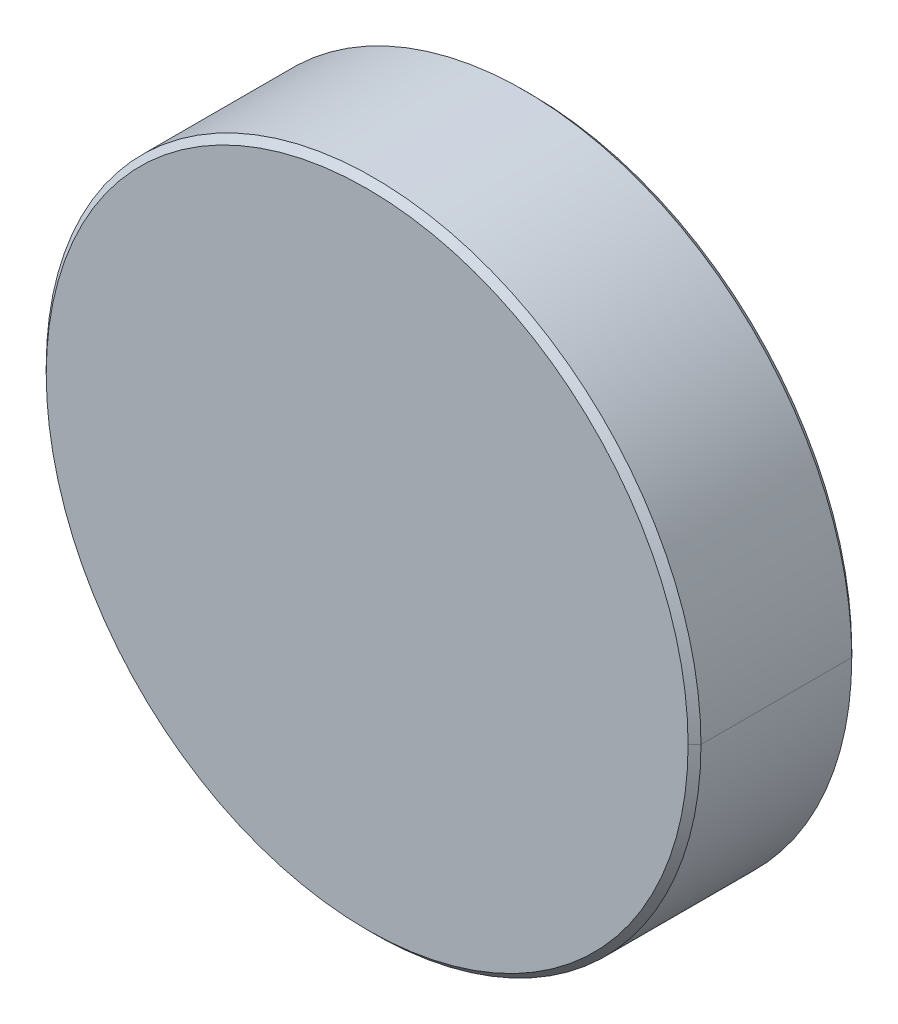
ISO-10303-21;
HEADER;
FILE_DESCRIPTION(('STEP AP214'),'2;1');
FILE_NAME('part.step','',(''),(''),'','','');
FILE_SCHEMA(('AUTOMOTIVE_DESIGN { 1 0 10303 214 1 1 1 1 }'));
ENDSEC;
DATA;
#1=APPLICATION_CONTEXT('core data for automotive mechanical design processes');
#2=APPLICATION_PROTOCOL_DEFINITION('international standard','automotive_design',2000,#1);
#3=PRODUCT_CONTEXT('',#1,'mechanical');
#4=PRODUCT('Part','Part','',(#3));
#5=PRODUCT_RELATED_PRODUCT_CATEGORY('part','',(#4));
#6=PRODUCT_DEFINITION_FORMATION('','',#4);
#7=PRODUCT_DEFINITION_CONTEXT('part definition',#1,'design');
#8=PRODUCT_DEFINITION('design','',#6,#7);
#9=PRODUCT_DEFINITION_SHAPE('','',#8);
#10=(LENGTH_UNIT() NAMED_UNIT(*) SI_UNIT(.MILLI.,.METRE.));
#11=(NAMED_UNIT(*) PLANE_ANGLE_UNIT() SI_UNIT($,.RADIAN.));
#12=(NAMED_UNIT(*) SI_UNIT($,.STERADIAN.) SOLID_ANGLE_UNIT());
#13=UNCERTAINTY_MEASURE_WITH_UNIT(LENGTH_MEASURE(1.E-05),#10,'distance_accuracy_value','');
#14=(GEOMETRIC_REPRESENTATION_CONTEXT(3) GLOBAL_UNCERTAINTY_ASSIGNED_CONTEXT((#13)) GLOBAL_UNIT_ASSIGNED_CONTEXT((#10,
#11,#12)) REPRESENTATION_CONTEXT('',''));
#15=CARTESIAN_POINT('',(0.,0.,0.));
#16=DIRECTION('',(0.,0.,1.));
#17=DIRECTION('',(1.,0.,0.));
#18=AXIS2_PLACEMENT_3D('',#15,#16,#17);
#19=CARTESIAN_POINT('',(0.,0.,3.175));
#20=DIRECTION('',(0.,0.,-1.));
#21=DIRECTION('',(-1.,0.,0.));
#22=AXIS2_PLACEMENT_3D('',#19,#20,#21);
#23=CONICAL_SURFACE('',#22,12.45,0.785398163397435);
#24=CARTESIAN_POINT('',(0.,0.,3.175));
#25=DIRECTION('',(0.,0.,1.));
#26=DIRECTION('',(1.,0.,0.));
#27=AXIS2_PLACEMENT_3D('',#24,#25,#26);
#28=CIRCLE('',#27,12.45);
#29=CARTESIAN_POINT('',(12.45,0.,3.175));
#30=VERTEX_POINT('',#29);
#31=CARTESIAN_POINT('',(-12.45,0.,3.175));
#32=VERTEX_POINT('',#31);
#33=EDGE_CURVE('E41',#30,#32,#28,.T.);
#34=ORIENTED_EDGE('',*,*,#33,.F.);
#35=DIRECTION('',(0.707106781186538,0.,-0.707106781186557));
#36=VECTOR('',#35,1.);
#37=CARTESIAN_POINT('',(12.45,0.,3.175));
#38=LINE('',#37,#36);
#39=CARTESIAN_POINT('',(12.7,0.,2.925));
#40=VERTEX_POINT('',#39);
#41=EDGE_CURVE('E11',#30,#40,#38,.T.);
#42=ORIENTED_EDGE('',*,*,#41,.T.);
#43=CARTESIAN_POINT('',(0.,0.,2.925));
#44=DIRECTION('',(0.,0.,-1.));
#45=DIRECTION('',(1.,0.,0.));
#46=AXIS2_PLACEMENT_3D('',#43,#44,#45);
#47=CIRCLE('',#46,12.7);
#48=CARTESIAN_POINT('',(-12.7,0.,2.925));
#49=VERTEX_POINT('',#48);
#50=EDGE_CURVE('E96',#49,#40,#47,.T.);
#51=ORIENTED_EDGE('',*,*,#50,.F.);
#52=DIRECTION('',(-0.707106781186538,0.,-0.707106781186557));
#53=VECTOR('',#52,1.);
#54=CARTESIAN_POINT('',(-12.45,0.,3.175));
#55=LINE('',#54,#53);
#56=EDGE_CURVE('E113',#32,#49,#55,.T.);
#57=ORIENTED_EDGE('',*,*,#56,.F.);
#58=EDGE_LOOP('',(#34,#42,#51,#57));
#59=FACE_BOUND('',#58,.T.);
#60=ADVANCED_FACE('F16',(#59),#23,.T.);
#61=CARTESIAN_POINT('',(0.,0.,-2.925));
#62=DIRECTION('',(0.,0.,1.));
#63=DIRECTION('',(1.,0.,0.));
#64=AXIS2_PLACEMENT_3D('',#61,#62,#63);
#65=CONICAL_SURFACE('',#64,12.7,0.785398163397448);
#66=CARTESIAN_POINT('',(0.,0.,-3.175));
#67=DIRECTION('',(0.,0.,-1.));
#68=DIRECTION('',(1.,0.,0.));
#69=AXIS2_PLACEMENT_3D('',#66,#67,#68);
#70=CIRCLE('',#69,12.45);
#71=CARTESIAN_POINT('',(-12.45,0.,-3.175));
#72=VERTEX_POINT('',#71);
#73=CARTESIAN_POINT('',(12.45,0.,-3.175));
#74=VERTEX_POINT('',#73);
#75=EDGE_CURVE('E91',#72,#74,#70,.T.);
#76=ORIENTED_EDGE('',*,*,#75,.F.);
#77=DIRECTION('',(-0.707106781186548,0.,0.707106781186548));
#78=VECTOR('',#77,1.);
#79=CARTESIAN_POINT('',(-12.7,0.,-2.925));
#80=LINE('',#79,#78);
#81=CARTESIAN_POINT('',(-12.7,0.,-2.925));
#82=VERTEX_POINT('',#81);
#83=EDGE_CURVE('E27',#72,#82,#80,.T.);
#84=ORIENTED_EDGE('',*,*,#83,.T.);
#85=CARTESIAN_POINT('',(0.,0.,-2.925));
#86=DIRECTION('',(0.,0.,1.));
#87=DIRECTION('',(1.,0.,0.));
#88=AXIS2_PLACEMENT_3D('',#85,#86,#87);
#89=CIRCLE('',#88,12.7);
#90=CARTESIAN_POINT('',(12.7,0.,-2.925));
#91=VERTEX_POINT('',#90);
#92=EDGE_CURVE('E82',#91,#82,#89,.T.);
#93=ORIENTED_EDGE('',*,*,#92,.F.);
#94=DIRECTION('',(0.707106781186548,0.,0.707106781186548));
#95=VECTOR('',#94,1.);
#96=CARTESIAN_POINT('',(12.7,0.,-2.925));
#97=LINE('',#96,#95);
#98=EDGE_CURVE('E99',#74,#91,#97,.T.);
#99=ORIENTED_EDGE('',*,*,#98,.F.);
#100=EDGE_LOOP('',(#76,#84,#93,#99));
#101=FACE_BOUND('',#100,.T.);
#102=ADVANCED_FACE('F18',(#101),#65,.T.);
#103=CARTESIAN_POINT('',(0.,0.,3.175));
#104=DIRECTION('',(0.,0.,-1.));
#105=DIRECTION('',(-1.,0.,0.));
#106=AXIS2_PLACEMENT_3D('',#103,#104,#105);
#107=CYLINDRICAL_SURFACE('',#106,12.7);
#108=ORIENTED_EDGE('',*,*,#50,.T.);
#109=DIRECTION('',(0.,0.,-1.));
#110=VECTOR('',#109,1.);
#111=CARTESIAN_POINT('',(12.7,0.,3.175));
#112=LINE('',#111,#110);
#113=EDGE_CURVE('E85',#40,#91,#112,.T.);
#114=ORIENTED_EDGE('',*,*,#113,.T.);
#115=ORIENTED_EDGE('',*,*,#92,.T.);
#116=DIRECTION('',(0.,0.,-1.));
#117=VECTOR('',#116,1.);
#118=CARTESIAN_POINT('',(-12.7,0.,3.175));
#119=LINE('',#118,#117);
#120=EDGE_CURVE('E20',#49,#82,#119,.T.);
#121=ORIENTED_EDGE('',*,*,#120,.F.);
#122=EDGE_LOOP('',(#108,#114,#115,#121));
#123=FACE_BOUND('',#122,.T.);
#124=ADVANCED_FACE('F84',(#123),#107,.T.);
#125=CARTESIAN_POINT('',(0.,0.,3.175));
#126=DIRECTION('',(0.,0.,-1.));
#127=DIRECTION('',(-1.,0.,0.));
#128=AXIS2_PLACEMENT_3D('',#125,#126,#127);
#129=CYLINDRICAL_SURFACE('',#128,12.7);
#130=ORIENTED_EDGE('',*,*,#113,.F.);
#131=CARTESIAN_POINT('',(0.,0.,2.925));
#132=DIRECTION('',(0.,0.,-1.));
#133=DIRECTION('',(1.,0.,0.));
#134=AXIS2_PLACEMENT_3D('',#131,#132,#133);
#135=CIRCLE('',#134,12.7);
#136=EDGE_CURVE('E75',#40,#49,#135,.T.);
#137=ORIENTED_EDGE('',*,*,#136,.T.);
#138=ORIENTED_EDGE('',*,*,#120,.T.);
#139=CARTESIAN_POINT('',(0.,0.,-2.925));
#140=DIRECTION('',(0.,0.,1.));
#141=DIRECTION('',(1.,0.,0.));
#142=AXIS2_PLACEMENT_3D('',#139,#140,#141);
#143=CIRCLE('',#142,12.7);
#144=EDGE_CURVE('E73',#82,#91,#143,.T.);
#145=ORIENTED_EDGE('',*,*,#144,.T.);
#146=EDGE_LOOP('',(#130,#137,#138,#145));
#147=FACE_BOUND('',#146,.T.);
#148=ADVANCED_FACE('F71',(#147),#129,.T.);
#149=CARTESIAN_POINT('',(0.,0.,3.175));
#150=DIRECTION('',(0.,0.,1.));
#151=DIRECTION('',(1.,0.,0.));
#152=AXIS2_PLACEMENT_3D('',#149,#150,#151);
#153=PLANE('',#152);
#154=CARTESIAN_POINT('',(0.,0.,3.175));
#155=DIRECTION('',(0.,0.,1.));
#156=DIRECTION('',(1.,0.,0.));
#157=AXIS2_PLACEMENT_3D('',#154,#155,#156);
#158=CIRCLE('',#157,12.45);
#159=EDGE_CURVE('E101',#32,#30,#158,.T.);
#160=ORIENTED_EDGE('',*,*,#159,.T.);
#161=ORIENTED_EDGE('',*,*,#33,.T.);
#162=EDGE_LOOP('',(#160,#161));
#163=FACE_BOUND('',#162,.T.);
#164=ADVANCED_FACE('F161',(#163),#153,.T.);
#165=CARTESIAN_POINT('',(0.,0.,-3.175));
#166=DIRECTION('',(0.,0.,1.));
#167=DIRECTION('',(1.,0.,0.));
#168=AXIS2_PLACEMENT_3D('',#165,#166,#167);
#169=PLANE('',#168);
#170=CARTESIAN_POINT('',(0.,0.,-3.175));
#171=DIRECTION('',(0.,0.,-1.));
#172=DIRECTION('',(1.,0.,0.));
#173=AXIS2_PLACEMENT_3D('',#170,#171,#172);
#174=CIRCLE('',#173,12.45);
#175=EDGE_CURVE('E126',#74,#72,#174,.T.);
#176=ORIENTED_EDGE('',*,*,#175,.T.);
#177=ORIENTED_EDGE('',*,*,#75,.T.);
#178=EDGE_LOOP('',(#176,#177));
#179=FACE_BOUND('',#178,.T.);
#180=ADVANCED_FACE('F173',(#179),#169,.F.);
#181=CARTESIAN_POINT('',(0.,0.,-2.925));
#182=DIRECTION('',(0.,0.,1.));
#183=DIRECTION('',(1.,0.,0.));
#184=AXIS2_PLACEMENT_3D('',#181,#182,#183);
#185=CONICAL_SURFACE('',#184,12.7,0.785398163397448);
#186=ORIENTED_EDGE('',*,*,#83,.F.);
#187=ORIENTED_EDGE('',*,*,#175,.F.);
#188=ORIENTED_EDGE('',*,*,#98,.T.);
#189=ORIENTED_EDGE('',*,*,#144,.F.);
#190=EDGE_LOOP('',(#186,#187,#188,#189));
#191=FACE_BOUND('',#190,.T.);
#192=ADVANCED_FACE('F98',(#191),#185,.T.);
#193=CARTESIAN_POINT('',(0.,0.,3.175));
#194=DIRECTION('',(0.,0.,-1.));
#195=DIRECTION('',(-1.,0.,0.));
#196=AXIS2_PLACEMENT_3D('',#193,#194,#195);
#197=CONICAL_SURFACE('',#196,12.45,0.785398163397435);
#198=ORIENTED_EDGE('',*,*,#41,.F.);
#199=ORIENTED_EDGE('',*,*,#159,.F.);
#200=ORIENTED_EDGE('',*,*,#56,.T.);
#201=ORIENTED_EDGE('',*,*,#136,.F.);
#202=EDGE_LOOP('',(#198,#199,#200,#201));
#203=FACE_BOUND('',#202,.T.);
#204=ADVANCED_FACE('F185',(#203),#197,.T.);
#205=CLOSED_SHELL('',(#60,#102,#124,#148,#164,#180,#192,#204));
#206=MANIFOLD_SOLID_BREP('B1',#205);
#207=ADVANCED_BREP_SHAPE_REPRESENTATION('',(#18,#206),#14);
#208=SHAPE_DEFINITION_REPRESENTATION(#9,#207);
ENDSEC;
END-ISO-10303-21;
